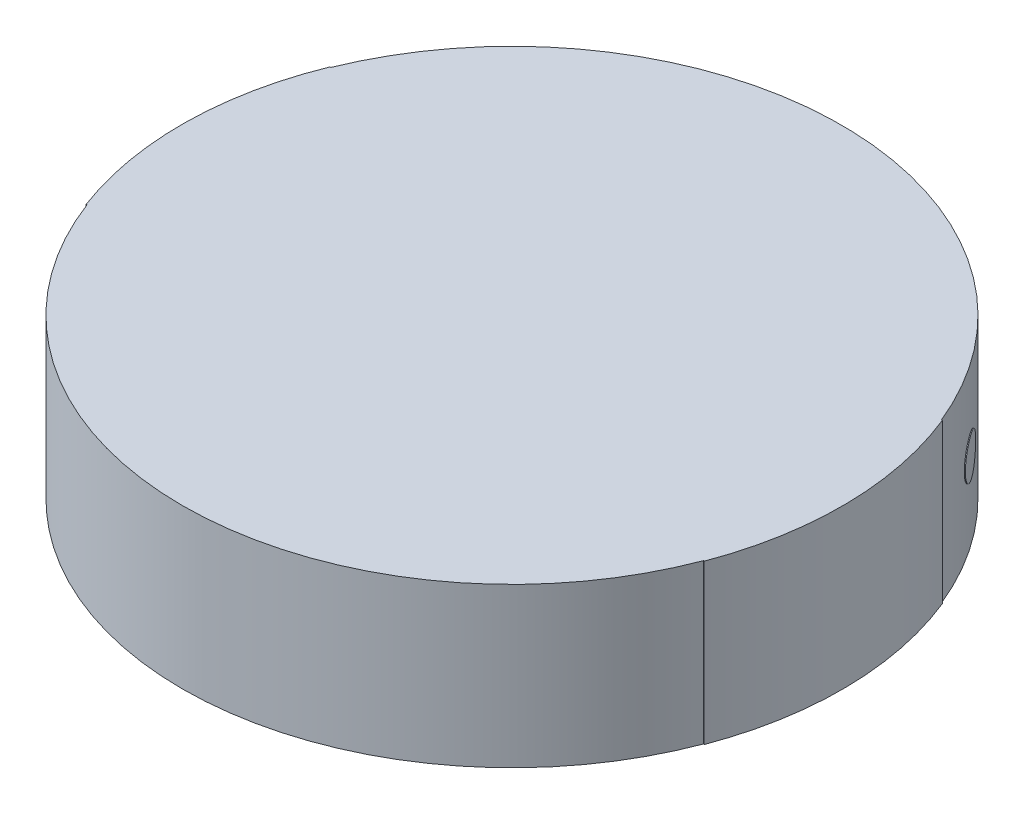
ISO-10303-21;
HEADER;
FILE_DESCRIPTION(('STEP AP214'),'2;1');
FILE_NAME('part.step','',(''),(''),'','','');
FILE_SCHEMA(('AUTOMOTIVE_DESIGN { 1 0 10303 214 1 1 1 1 }'));
ENDSEC;
DATA;
#1=APPLICATION_CONTEXT('core data for automotive mechanical design processes');
#2=APPLICATION_PROTOCOL_DEFINITION('international standard','automotive_design',2000,#1);
#3=PRODUCT_CONTEXT('',#1,'mechanical');
#4=PRODUCT('Part','Part','',(#3));
#5=PRODUCT_RELATED_PRODUCT_CATEGORY('part','',(#4));
#6=PRODUCT_DEFINITION_FORMATION('','',#4);
#7=PRODUCT_DEFINITION_CONTEXT('part definition',#1,'design');
#8=PRODUCT_DEFINITION('design','',#6,#7);
#9=PRODUCT_DEFINITION_SHAPE('','',#8);
#10=(LENGTH_UNIT() NAMED_UNIT(*) SI_UNIT(.MILLI.,.METRE.));
#11=(NAMED_UNIT(*) PLANE_ANGLE_UNIT() SI_UNIT($,.RADIAN.));
#12=(NAMED_UNIT(*) SI_UNIT($,.STERADIAN.) SOLID_ANGLE_UNIT());
#13=UNCERTAINTY_MEASURE_WITH_UNIT(LENGTH_MEASURE(1.E-05),#10,'distance_accuracy_value','');
#14=(GEOMETRIC_REPRESENTATION_CONTEXT(3) GLOBAL_UNCERTAINTY_ASSIGNED_CONTEXT((#13)) GLOBAL_UNIT_ASSIGNED_CONTEXT((#10,
#11,#12)) REPRESENTATION_CONTEXT('',''));
#15=CARTESIAN_POINT('',(0.,0.,0.));
#16=DIRECTION('',(0.,0.,1.));
#17=DIRECTION('',(1.,0.,0.));
#18=AXIS2_PLACEMENT_3D('',#15,#16,#17);
#19=CARTESIAN_POINT('',(0.,2.,0.));
#20=DIRECTION('',(0.,-1.,0.));
#21=DIRECTION('',(0.,0.,-1.));
#22=AXIS2_PLACEMENT_3D('',#19,#20,#21);
#23=CYLINDRICAL_SURFACE('',#22,4.15);
#24=CARTESIAN_POINT('',(3.27171196649209,1.,-2.55311590185648));
#25=CARTESIAN_POINT('',(3.27179390586077,1.06659109797606,-2.55301089995946));
#26=CARTESIAN_POINT('',(3.28809508042966,1.12993035868716,-2.53241457169002));
#27=CARTESIAN_POINT('',(3.34440087998526,1.2236230166176,-2.45757514123322));
#28=CARTESIAN_POINT('',(3.38195425068374,1.24998679026527,-2.40609078556478));
#29=CARTESIAN_POINT('',(3.45701863991068,1.25001320768777,-2.29693481522825));
#30=CARTESIAN_POINT('',(3.49164458622082,1.22360415277622,-2.24345997363565));
#31=CARTESIAN_POINT('',(3.54139787580177,1.12994919176796,-2.16406923527349));
#32=CARTESIAN_POINT('',(3.55478739656431,1.06595096524728,-2.14149167231975));
#33=CARTESIAN_POINT('',(3.55492347564171,0.934048988847038,-2.14126577045419));
#34=CARTESIAN_POINT('',(3.5413880008748,0.870069646181466,-2.16408499327242));
#35=CARTESIAN_POINT('',(3.49165442644874,0.776376944812536,-2.24344427100559));
#36=CARTESIAN_POINT('',(3.45701845968599,0.750013269719223,-2.29693507859742));
#37=CARTESIAN_POINT('',(3.38195437889558,0.749986731627781,-2.40609059783085));
#38=CARTESIAN_POINT('',(3.34441217971716,0.776395645154479,-2.45756012268589));
#39=CARTESIAN_POINT('',(3.28808374181886,0.870051044706398,-2.53242964191365));
#40=CARTESIAN_POINT('',(3.27163002712342,0.93340890202394,-2.55322090375351));
#41=CARTESIAN_POINT('',(3.27171196649209,1.,-2.55311590185648));
#42=B_SPLINE_CURVE_WITH_KNOTS('',3,(#24,#25,#26,#27,#28,#29,#30,#31,#32,#33,#34,#35,#36,#37,#38,
#39,#40,#41),.UNSPECIFIED.,.T.,.F.,(4,2,2,2,2,2,2,2,4),(0.,0.125,0.25,0.375,0.5,0.625,0.75,
0.875,1.),.UNSPECIFIED.);
#43=CARTESIAN_POINT('',(3.27171196649209,1.,-2.55311590185648));
#44=VERTEX_POINT('',#43);
#45=EDGE_CURVE('E15',#44,#44,#42,.T.);
#46=ORIENTED_EDGE('',*,*,#45,.F.);
#47=EDGE_LOOP('',(#46));
#48=FACE_BOUND('',#47,.T.);
#49=CARTESIAN_POINT('',(0.,0.,0.));
#50=DIRECTION('',(0.,1.,0.));
#51=DIRECTION('',(0.,0.,1.));
#52=AXIS2_PLACEMENT_3D('',#49,#50,#51);
#53=CIRCLE('',#52,4.15);
#54=CARTESIAN_POINT('',(3.84536792228623,0.,-1.56065548480504));
#55=VERTEX_POINT('',#54);
#56=CARTESIAN_POINT('',(-3.84536792228623,0.,-1.56065548480504));
#57=VERTEX_POINT('',#56);
#58=EDGE_CURVE('E174',#55,#57,#53,.T.);
#59=ORIENTED_EDGE('',*,*,#58,.T.);
#60=DIRECTION('',(0.,1.,0.));
#61=VECTOR('',#60,1.);
#62=CARTESIAN_POINT('',(-3.84536792228623,0.,-1.56065548480504));
#63=LINE('',#62,#61);
#64=CARTESIAN_POINT('',(-3.84536792228623,2.,-1.56065548480504));
#65=VERTEX_POINT('',#64);
#66=EDGE_CURVE('E122',#57,#65,#63,.T.);
#67=ORIENTED_EDGE('',*,*,#66,.T.);
#68=CARTESIAN_POINT('',(0.,2.,0.));
#69=DIRECTION('',(0.,1.,0.));
#70=DIRECTION('',(0.,0.,1.));
#71=AXIS2_PLACEMENT_3D('',#68,#69,#70);
#72=CIRCLE('',#71,4.15);
#73=CARTESIAN_POINT('',(3.84536792228623,2.,-1.56065548480504));
#74=VERTEX_POINT('',#73);
#75=EDGE_CURVE('E107',#74,#65,#72,.T.);
#76=ORIENTED_EDGE('',*,*,#75,.F.);
#77=DIRECTION('',(0.,1.,0.));
#78=VECTOR('',#77,1.);
#79=CARTESIAN_POINT('',(3.84536792228623,0.,-1.56065548480504));
#80=LINE('',#79,#78);
#81=EDGE_CURVE('E267',#55,#74,#80,.T.);
#82=ORIENTED_EDGE('',*,*,#81,.F.);
#83=EDGE_LOOP('',(#59,#67,#76,#82));
#84=FACE_BOUND('',#83,.T.);
#85=ADVANCED_FACE('F95',(#48,#84),#23,.T.);
#86=CARTESIAN_POINT('',(-3.88185411428932,2.,1.46755191914123));
#87=VERTEX_POINT('',#86);
#88=CARTESIAN_POINT('',(3.88185411428932,2.,1.46755191914123));
#89=VERTEX_POINT('',#88);
#90=EDGE_CURVE('E114',#87,#89,#72,.T.);
#91=ORIENTED_EDGE('',*,*,#90,.F.);
#92=DIRECTION('',(0.,-1.,0.));
#93=VECTOR('',#92,1.);
#94=CARTESIAN_POINT('',(-3.88185411428932,2.,1.46755191914123));
#95=LINE('',#94,#93);
#96=CARTESIAN_POINT('',(-3.88185411428932,0.,1.46755191914123));
#97=VERTEX_POINT('',#96);
#98=EDGE_CURVE('E178',#87,#97,#95,.T.);
#99=ORIENTED_EDGE('',*,*,#98,.T.);
#100=CARTESIAN_POINT('',(3.88185411428932,0.,1.46755191914123));
#101=VERTEX_POINT('',#100);
#102=EDGE_CURVE('E164',#97,#101,#53,.T.);
#103=ORIENTED_EDGE('',*,*,#102,.T.);
#104=DIRECTION('',(0.,-1.,0.));
#105=VECTOR('',#104,1.);
#106=CARTESIAN_POINT('',(3.88185411428932,2.,1.46755191914123));
#107=LINE('',#106,#105);
#108=EDGE_CURVE('E252',#89,#101,#107,.T.);
#109=ORIENTED_EDGE('',*,*,#108,.F.);
#110=EDGE_LOOP('',(#91,#99,#103,#109));
#111=FACE_BOUND('',#110,.T.);
#112=ADVANCED_FACE('F97',(#111),#23,.T.);
#113=CARTESIAN_POINT('',(0.,2.,0.));
#114=DIRECTION('',(0.,1.,0.));
#115=DIRECTION('',(0.,0.,1.));
#116=AXIS2_PLACEMENT_3D('',#113,#114,#115);
#117=PLANE('',#116);
#118=ORIENTED_EDGE('',*,*,#75,.T.);
#119=DIRECTION('',(0.926594680068972,0.,0.376061562603624));
#120=VECTOR('',#119,1.);
#121=CARTESIAN_POINT('',(-3.84536792228623,2.,-1.56065548480504));
#122=LINE('',#121,#120);
#123=CARTESIAN_POINT('',(-3.85463386908692,2.,-1.56441610043107));
#124=VERTEX_POINT('',#123);
#125=EDGE_CURVE('E193',#124,#65,#122,.T.);
#126=ORIENTED_EDGE('',*,*,#125,.F.);
#127=CARTESIAN_POINT('',(0.,2.,0.));
#128=DIRECTION('',(0.,-1.,0.));
#129=DIRECTION('',(0.,0.,-1.));
#130=AXIS2_PLACEMENT_3D('',#127,#128,#129);
#131=CIRCLE('',#130,4.16);
#132=CARTESIAN_POINT('',(-3.89120797962495,2.,1.47108818882591));
#133=VERTEX_POINT('',#132);
#134=EDGE_CURVE('E181',#124,#133,#131,.F.);
#135=ORIENTED_EDGE('',*,*,#134,.T.);
#136=DIRECTION('',(0.93538653356369,0.,-0.353626968467767));
#137=VECTOR('',#136,1.);
#138=CARTESIAN_POINT('',(-3.88185411428932,2.,1.46755191914123));
#139=LINE('',#138,#137);
#140=EDGE_CURVE('E188',#133,#87,#139,.T.);
#141=ORIENTED_EDGE('',*,*,#140,.T.);
#142=ORIENTED_EDGE('',*,*,#90,.T.);
#143=DIRECTION('',(0.935386533563691,0.,0.353626968467767));
#144=VECTOR('',#143,1.);
#145=CARTESIAN_POINT('',(3.88185411428932,2.,1.46755191914123));
#146=LINE('',#145,#144);
#147=CARTESIAN_POINT('',(3.89120797962495,2.,1.47108818882591));
#148=VERTEX_POINT('',#147);
#149=EDGE_CURVE('E175',#89,#148,#146,.T.);
#150=ORIENTED_EDGE('',*,*,#149,.T.);
#151=CARTESIAN_POINT('',(0.,2.,0.));
#152=DIRECTION('',(0.,-1.,0.));
#153=DIRECTION('',(0.,0.,-1.));
#154=AXIS2_PLACEMENT_3D('',#151,#152,#153);
#155=CIRCLE('',#154,4.16);
#156=CARTESIAN_POINT('',(3.85463386908692,2.,-1.56441610043108));
#157=VERTEX_POINT('',#156);
#158=EDGE_CURVE('E251',#148,#157,#155,.F.);
#159=ORIENTED_EDGE('',*,*,#158,.T.);
#160=DIRECTION('',(0.926594680068972,0.,-0.376061562603624));
#161=VECTOR('',#160,1.);
#162=CARTESIAN_POINT('',(3.84536792228623,2.,-1.56065548480504));
#163=LINE('',#162,#161);
#164=EDGE_CURVE('E257',#74,#157,#163,.T.);
#165=ORIENTED_EDGE('',*,*,#164,.F.);
#166=EDGE_LOOP('',(#118,#126,#135,#141,#142,#150,#159,#165));
#167=FACE_BOUND('',#166,.T.);
#168=ADVANCED_FACE('F316',(#167),#117,.T.);
#169=CARTESIAN_POINT('',(0.,0.,0.));
#170=DIRECTION('',(0.,1.,0.));
#171=DIRECTION('',(0.,0.,1.));
#172=AXIS2_PLACEMENT_3D('',#169,#170,#171);
#173=PLANE('',#172);
#174=ORIENTED_EDGE('',*,*,#58,.F.);
#175=DIRECTION('',(0.926594680068972,0.,-0.376061562603624));
#176=VECTOR('',#175,1.);
#177=CARTESIAN_POINT('',(3.84536792228623,0.,-1.56065548480504));
#178=LINE('',#177,#176);
#179=CARTESIAN_POINT('',(3.85463386908692,0.,-1.56441610043108));
#180=VERTEX_POINT('',#179);
#181=EDGE_CURVE('E272',#55,#180,#178,.T.);
#182=ORIENTED_EDGE('',*,*,#181,.T.);
#183=CARTESIAN_POINT('',(0.,0.,0.));
#184=DIRECTION('',(0.,-1.,0.));
#185=DIRECTION('',(0.,0.,-1.));
#186=AXIS2_PLACEMENT_3D('',#183,#184,#185);
#187=CIRCLE('',#186,4.16);
#188=CARTESIAN_POINT('',(3.89120797962495,0.,1.47108818882591));
#189=VERTEX_POINT('',#188);
#190=EDGE_CURVE('E253',#189,#180,#187,.F.);
#191=ORIENTED_EDGE('',*,*,#190,.F.);
#192=DIRECTION('',(0.935386533563691,0.,0.353626968467767));
#193=VECTOR('',#192,1.);
#194=CARTESIAN_POINT('',(3.88185411428932,0.,1.46755191914123));
#195=LINE('',#194,#193);
#196=EDGE_CURVE('E171',#101,#189,#195,.T.);
#197=ORIENTED_EDGE('',*,*,#196,.F.);
#198=ORIENTED_EDGE('',*,*,#102,.F.);
#199=DIRECTION('',(0.93538653356369,0.,-0.353626968467767));
#200=VECTOR('',#199,1.);
#201=CARTESIAN_POINT('',(-3.88185411428932,0.,1.46755191914123));
#202=LINE('',#201,#200);
#203=CARTESIAN_POINT('',(-3.89120797962495,0.,1.47108818882591));
#204=VERTEX_POINT('',#203);
#205=EDGE_CURVE('E168',#204,#97,#202,.T.);
#206=ORIENTED_EDGE('',*,*,#205,.F.);
#207=CARTESIAN_POINT('',(0.,0.,0.));
#208=DIRECTION('',(0.,-1.,0.));
#209=DIRECTION('',(0.,0.,-1.));
#210=AXIS2_PLACEMENT_3D('',#207,#208,#209);
#211=CIRCLE('',#210,4.16);
#212=CARTESIAN_POINT('',(-3.85463386908692,0.,-1.56441610043107));
#213=VERTEX_POINT('',#212);
#214=EDGE_CURVE('E289',#213,#204,#211,.F.);
#215=ORIENTED_EDGE('',*,*,#214,.F.);
#216=DIRECTION('',(0.926594680068972,0.,0.376061562603623));
#217=VECTOR('',#216,1.);
#218=CARTESIAN_POINT('',(-3.84536792228623,0.,-1.56065548480504));
#219=LINE('',#218,#217);
#220=EDGE_CURVE('E198',#213,#57,#219,.T.);
#221=ORIENTED_EDGE('',*,*,#220,.T.);
#222=EDGE_LOOP('',(#174,#182,#191,#197,#198,#206,#215,#221));
#223=FACE_BOUND('',#222,.T.);
#224=ADVANCED_FACE('F165',(#223),#173,.F.);
#225=CARTESIAN_POINT('',(3.88185411428932,1.,1.46755191914123));
#226=DIRECTION('',(-0.353626968467767,0.,0.935386533563691));
#227=DIRECTION('',(0.,-1.,0.));
#228=AXIS2_PLACEMENT_3D('',#225,#226,#227);
#229=PLANE('',#228);
#230=ORIENTED_EDGE('',*,*,#149,.F.);
#231=ORIENTED_EDGE('',*,*,#108,.T.);
#232=ORIENTED_EDGE('',*,*,#196,.T.);
#233=DIRECTION('',(0.,-1.,0.));
#234=VECTOR('',#233,1.);
#235=CARTESIAN_POINT('',(3.89120797962495,2.,1.47108818882591));
#236=LINE('',#235,#234);
#237=EDGE_CURVE('E258',#148,#189,#236,.T.);
#238=ORIENTED_EDGE('',*,*,#237,.F.);
#239=EDGE_LOOP('',(#230,#231,#232,#238));
#240=FACE_BOUND('',#239,.T.);
#241=ADVANCED_FACE('F321',(#240),#229,.T.);
#242=CARTESIAN_POINT('',(3.84536792228623,1.,-1.56065548480504));
#243=DIRECTION('',(-0.376061562603624,0.,-0.926594680068972));
#244=DIRECTION('',(0.,1.,0.));
#245=AXIS2_PLACEMENT_3D('',#242,#243,#244);
#246=PLANE('',#245);
#247=ORIENTED_EDGE('',*,*,#181,.F.);
#248=ORIENTED_EDGE('',*,*,#81,.T.);
#249=ORIENTED_EDGE('',*,*,#164,.T.);
#250=DIRECTION('',(0.,-1.,0.));
#251=VECTOR('',#250,1.);
#252=CARTESIAN_POINT('',(3.85463386908692,2.,-1.56441610043108));
#253=LINE('',#252,#251);
#254=EDGE_CURVE('E242',#180,#157,#253,.F.);
#255=ORIENTED_EDGE('',*,*,#254,.F.);
#256=EDGE_LOOP('',(#247,#248,#249,#255));
#257=FACE_BOUND('',#256,.T.);
#258=ADVANCED_FACE('F325',(#257),#246,.T.);
#259=CARTESIAN_POINT('',(0.,2.,0.));
#260=DIRECTION('',(0.,-1.,0.));
#261=DIRECTION('',(0.,0.,-1.));
#262=AXIS2_PLACEMENT_3D('',#259,#260,#261);
#263=CYLINDRICAL_SURFACE('',#262,4.16);
#264=ORIENTED_EDGE('',*,*,#254,.T.);
#265=ORIENTED_EDGE('',*,*,#158,.F.);
#266=ORIENTED_EDGE('',*,*,#237,.T.);
#267=ORIENTED_EDGE('',*,*,#190,.T.);
#268=EDGE_LOOP('',(#264,#265,#266,#267));
#269=FACE_BOUND('',#268,.T.);
#270=ADVANCED_FACE('F225',(#269),#263,.T.);
#271=CARTESIAN_POINT('',(3.27959560978485,1.,-2.55926798836698));
#272=CARTESIAN_POINT('',(3.27967774659778,1.06659109797606,-2.55916273345334));
#273=CARTESIAN_POINT('',(3.29601820110539,1.12993035868716,-2.53851677547723));
#274=CARTESIAN_POINT('',(3.35245967728643,1.2236230166176,-2.46349700904342));
#275=CARTESIAN_POINT('',(3.39010353803478,1.24998679026527,-2.41188859468662));
#276=CARTESIAN_POINT('',(3.46534880530806,1.25001320768777,-2.30246959791555));
#277=CARTESIAN_POINT('',(3.5000581876334,1.22360415277622,-2.24886590128297));
#278=CARTESIAN_POINT('',(3.54993136465912,1.12994919176796,-2.1692838599368));
#279=CARTESIAN_POINT('',(3.56335314932711,1.06595096524728,-2.14665189321691));
#280=CARTESIAN_POINT('',(3.5634895563059,0.934048988847038,-2.14642544700951));
#281=CARTESIAN_POINT('',(3.54992146593715,0.870069646181466,-2.16929965590681));
#282=CARTESIAN_POINT('',(3.50006805157272,0.776376944812536,-2.24885016081524));
#283=CARTESIAN_POINT('',(3.46534862464909,0.750013269719223,-2.30246986191934));
#284=CARTESIAN_POINT('',(3.39010366655557,0.749986731627781,-2.41188840650032));
#285=CARTESIAN_POINT('',(3.3524710042466,0.776395645154479,-2.46348195430682));
#286=CARTESIAN_POINT('',(3.29600683517264,0.870051044706398,-2.53853188201464));
#287=CARTESIAN_POINT('',(3.27951347297191,0.93340890202394,-2.55937324328062));
#288=CARTESIAN_POINT('',(3.27959560978485,1.,-2.55926798836698));
#289=CARTESIAN_POINT('',(3.27171196649209,1.,-2.55311590185648));
#290=CARTESIAN_POINT('',(3.27179390586077,1.06659109797606,-2.55301089995946));
#291=CARTESIAN_POINT('',(3.28809508042966,1.12993035868716,-2.53241457169002));
#292=CARTESIAN_POINT('',(3.34440087998526,1.2236230166176,-2.45757514123322));
#293=CARTESIAN_POINT('',(3.38195425068374,1.24998679026527,-2.40609078556478));
#294=CARTESIAN_POINT('',(3.45701863991068,1.25001320768777,-2.29693481522825));
#295=CARTESIAN_POINT('',(3.49164458622082,1.22360415277622,-2.24345997363565));
#296=CARTESIAN_POINT('',(3.54139787580177,1.12994919176796,-2.16406923527349));
#297=CARTESIAN_POINT('',(3.55478739656431,1.06595096524728,-2.14149167231975));
#298=CARTESIAN_POINT('',(3.55492347564171,0.934048988847038,-2.14126577045419));
#299=CARTESIAN_POINT('',(3.5413880008748,0.870069646181466,-2.16408499327242));
#300=CARTESIAN_POINT('',(3.49165442644874,0.776376944812536,-2.24344427100559));
#301=CARTESIAN_POINT('',(3.45701845968599,0.750013269719223,-2.29693507859742));
#302=CARTESIAN_POINT('',(3.38195437889558,0.749986731627781,-2.40609059783085));
#303=CARTESIAN_POINT('',(3.34441217971716,0.776395645154479,-2.45756012268589));
#304=CARTESIAN_POINT('',(3.28808374181886,0.870051044706398,-2.53242964191365));
#305=CARTESIAN_POINT('',(3.27163002712342,0.93340890202394,-2.55322090375351));
#306=CARTESIAN_POINT('',(3.27171196649209,1.,-2.55311590185648));
#307=B_SPLINE_SURFACE_WITH_KNOTS('',1,3,((#271,#272,#273,#274,#275,#276,#277,#278,#279,#280,
#281,#282,#283,#284,#285,#286,#287,#288),(#289,#290,#291,#292,#293,#294,#295,#296,#297,#298,
#299,#300,#301,#302,#303,#304,#305,#306)),.UNSPECIFIED.,.F.,.T.,.F.,(2,2),(4,2,2,2,2,2,2,2,4),
(0.,1.),(0.,0.125,0.25,0.375,0.5,0.625,0.75,0.875,1.),.UNSPECIFIED.);
#308=CARTESIAN_POINT('',(3.27959560978485,1.,-2.55926798836698));
#309=CARTESIAN_POINT('',(3.27951347297191,0.93340890202394,-2.55937324328062));
#310=CARTESIAN_POINT('',(3.29600683517264,0.870051044706398,-2.53853188201464));
#311=CARTESIAN_POINT('',(3.3524710042466,0.776395645154479,-2.46348195430682));
#312=CARTESIAN_POINT('',(3.39010366655557,0.749986731627781,-2.41188840650032));
#313=CARTESIAN_POINT('',(3.46534862464909,0.750013269719223,-2.30246986191934));
#314=CARTESIAN_POINT('',(3.50006805157272,0.776376944812536,-2.24885016081524));
#315=CARTESIAN_POINT('',(3.54992146593715,0.870069646181466,-2.16929965590681));
#316=CARTESIAN_POINT('',(3.5634895563059,0.934048988847038,-2.14642544700951));
#317=CARTESIAN_POINT('',(3.56335314932711,1.06595096524728,-2.14665189321691));
#318=CARTESIAN_POINT('',(3.54993136465912,1.12994919176796,-2.1692838599368));
#319=CARTESIAN_POINT('',(3.5000581876334,1.22360415277622,-2.24886590128297));
#320=CARTESIAN_POINT('',(3.46534880530806,1.25001320768777,-2.30246959791555));
#321=CARTESIAN_POINT('',(3.39010353803478,1.24998679026527,-2.41188859468662));
#322=CARTESIAN_POINT('',(3.35245967728643,1.2236230166176,-2.46349700904342));
#323=CARTESIAN_POINT('',(3.29601820110539,1.12993035868716,-2.53851677547723));
#324=CARTESIAN_POINT('',(3.27967774659778,1.06659109797606,-2.55916273345334));
#325=CARTESIAN_POINT('',(3.27959560978485,1.,-2.55926798836698));
#326=B_SPLINE_CURVE_WITH_KNOTS('',3,(#308,#309,#310,#311,#312,#313,#314,#315,#316,#317,#318,
#319,#320,#321,#322,#323,#324,#325),.UNSPECIFIED.,.T.,.F.,(4,2,2,2,2,2,2,2,4),(0.,0.125,0.25,
0.375,0.5,0.625,0.75,0.875,1.),.UNSPECIFIED.);
#327=CARTESIAN_POINT('',(3.27959560978485,1.,-2.55926798836698));
#328=VERTEX_POINT('',#327);
#329=EDGE_CURVE('E271',#328,#328,#326,.F.);
#330=ORIENTED_EDGE('',*,*,#329,.F.);
#331=EDGE_LOOP('',(#330));
#332=FACE_BOUND('',#331,.T.);
#333=ORIENTED_EDGE('',*,*,#45,.T.);
#334=EDGE_LOOP('',(#333));
#335=FACE_BOUND('',#334,.T.);
#336=ADVANCED_FACE('F217',(#332,#335),#307,.T.);
#337=CARTESIAN_POINT('',(0.,2.,0.));
#338=DIRECTION('',(0.,-1.,0.));
#339=DIRECTION('',(0.,0.,-1.));
#340=AXIS2_PLACEMENT_3D('',#337,#338,#339);
#341=CYLINDRICAL_SURFACE('',#340,4.16);
#342=ORIENTED_EDGE('',*,*,#329,.T.);
#343=EDGE_LOOP('',(#342));
#344=FACE_BOUND('',#343,.T.);
#345=ADVANCED_FACE('F206',(#344),#341,.T.);
#346=CARTESIAN_POINT('',(-3.84536792228623,1.,-1.56065548480504));
#347=DIRECTION('',(-0.376061562603623,0.,0.926594680068972));
#348=DIRECTION('',(0.,1.,0.));
#349=AXIS2_PLACEMENT_3D('',#346,#347,#348);
#350=PLANE('',#349);
#351=ORIENTED_EDGE('',*,*,#220,.F.);
#352=DIRECTION('',(0.,-1.,0.));
#353=VECTOR('',#352,1.);
#354=CARTESIAN_POINT('',(-3.85463386908692,2.,-1.56441610043107));
#355=LINE('',#354,#353);
#356=EDGE_CURVE('E295',#213,#124,#355,.F.);
#357=ORIENTED_EDGE('',*,*,#356,.T.);
#358=ORIENTED_EDGE('',*,*,#125,.T.);
#359=ORIENTED_EDGE('',*,*,#66,.F.);
#360=EDGE_LOOP('',(#351,#357,#358,#359));
#361=FACE_BOUND('',#360,.T.);
#362=ADVANCED_FACE('F216',(#361),#350,.F.);
#363=CARTESIAN_POINT('',(-3.88185411428932,1.,1.46755191914123));
#364=DIRECTION('',(-0.353626968467766,0.,-0.935386533563691));
#365=DIRECTION('',(0.,-1.,0.));
#366=AXIS2_PLACEMENT_3D('',#363,#364,#365);
#367=PLANE('',#366);
#368=ORIENTED_EDGE('',*,*,#140,.F.);
#369=DIRECTION('',(0.,-1.,0.));
#370=VECTOR('',#369,1.);
#371=CARTESIAN_POINT('',(-3.89120797962495,2.,1.47108818882591));
#372=LINE('',#371,#370);
#373=EDGE_CURVE('E186',#133,#204,#372,.T.);
#374=ORIENTED_EDGE('',*,*,#373,.T.);
#375=ORIENTED_EDGE('',*,*,#205,.T.);
#376=ORIENTED_EDGE('',*,*,#98,.F.);
#377=EDGE_LOOP('',(#368,#374,#375,#376));
#378=FACE_BOUND('',#377,.T.);
#379=ADVANCED_FACE('F184',(#378),#367,.F.);
#380=CARTESIAN_POINT('',(0.,2.,0.));
#381=DIRECTION('',(0.,-1.,0.));
#382=DIRECTION('',(0.,0.,-1.));
#383=AXIS2_PLACEMENT_3D('',#380,#381,#382);
#384=CYLINDRICAL_SURFACE('',#383,4.16);
#385=ORIENTED_EDGE('',*,*,#373,.F.);
#386=ORIENTED_EDGE('',*,*,#134,.F.);
#387=ORIENTED_EDGE('',*,*,#356,.F.);
#388=ORIENTED_EDGE('',*,*,#214,.T.);
#389=EDGE_LOOP('',(#385,#386,#387,#388));
#390=FACE_BOUND('',#389,.T.);
#391=ADVANCED_FACE('F377',(#390),#384,.T.);
#392=CLOSED_SHELL('',(#85,#112,#168,#224,#241,#258,#270,#336,#345,#362,#379,#391));
#393=MANIFOLD_SOLID_BREP('B2',#392);
#394=ADVANCED_BREP_SHAPE_REPRESENTATION('',(#18,#393),#14);
#395=SHAPE_DEFINITION_REPRESENTATION(#9,#394);
ENDSEC;
END-ISO-10303-21;
